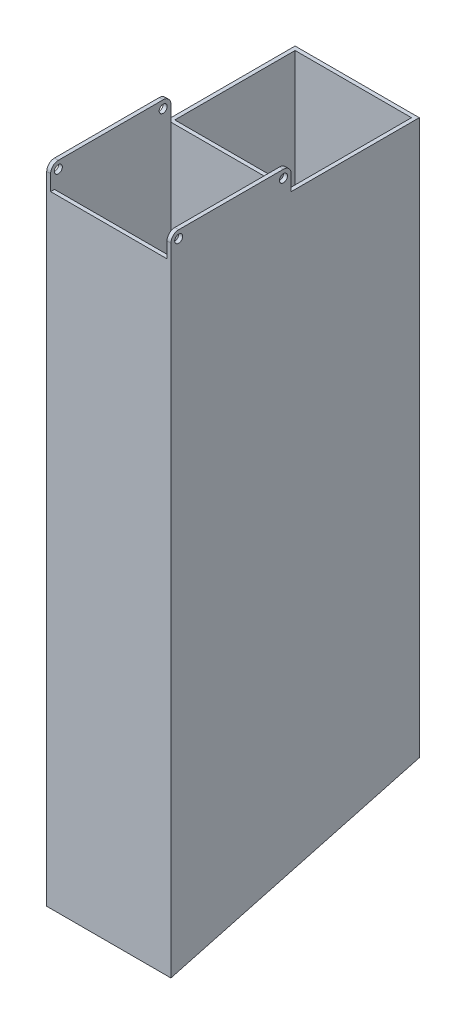
ISO-10303-21;
HEADER;
FILE_DESCRIPTION(('STEP AP214'),'2;1');
FILE_NAME('part.step','',(''),(''),'','','');
FILE_SCHEMA(('AUTOMOTIVE_DESIGN { 1 0 10303 214 1 1 1 1 }'));
ENDSEC;
DATA;
#1=APPLICATION_CONTEXT('core data for automotive mechanical design processes');
#2=APPLICATION_PROTOCOL_DEFINITION('international standard','automotive_design',2000,#1);
#3=PRODUCT_CONTEXT('',#1,'mechanical');
#4=PRODUCT('Part','Part','',(#3));
#5=PRODUCT_RELATED_PRODUCT_CATEGORY('part','',(#4));
#6=PRODUCT_DEFINITION_FORMATION('','',#4);
#7=PRODUCT_DEFINITION_CONTEXT('part definition',#1,'design');
#8=PRODUCT_DEFINITION('design','',#6,#7);
#9=PRODUCT_DEFINITION_SHAPE('','',#8);
#10=(LENGTH_UNIT() NAMED_UNIT(*) SI_UNIT(.MILLI.,.METRE.));
#11=(NAMED_UNIT(*) PLANE_ANGLE_UNIT() SI_UNIT($,.RADIAN.));
#12=(NAMED_UNIT(*) SI_UNIT($,.STERADIAN.) SOLID_ANGLE_UNIT());
#13=UNCERTAINTY_MEASURE_WITH_UNIT(LENGTH_MEASURE(1.E-05),#10,'distance_accuracy_value','');
#14=(GEOMETRIC_REPRESENTATION_CONTEXT(3) GLOBAL_UNCERTAINTY_ASSIGNED_CONTEXT((#13)) GLOBAL_UNIT_ASSIGNED_CONTEXT((#10,
#11,#12)) REPRESENTATION_CONTEXT('',''));
#15=CARTESIAN_POINT('',(0.,0.,0.));
#16=DIRECTION('',(0.,0.,1.));
#17=DIRECTION('',(1.,0.,0.));
#18=AXIS2_PLACEMENT_3D('',#15,#16,#17);
#19=CARTESIAN_POINT('',(0.,127.,0.));
#20=DIRECTION('',(0.,-1.,0.));
#21=DIRECTION('',(-1.,0.,0.));
#22=AXIS2_PLACEMENT_3D('',#19,#20,#21);
#23=PLANE('',#22);
#24=DIRECTION('',(0.,0.,1.));
#25=VECTOR('',#24,1.);
#26=CARTESIAN_POINT('',(23.8125,127.,-25.4));
#27=LINE('',#26,#25);
#28=CARTESIAN_POINT('',(23.8125,127.,-23.8125));
#29=VERTEX_POINT('',#28);
#30=CARTESIAN_POINT('',(23.8125,127.,25.4));
#31=VERTEX_POINT('',#30);
#32=EDGE_CURVE('E299',#29,#31,#27,.T.);
#33=ORIENTED_EDGE('',*,*,#32,.T.);
#34=DIRECTION('',(1.,0.,0.));
#35=VECTOR('',#34,1.);
#36=CARTESIAN_POINT('',(-25.4,127.,25.4));
#37=LINE('',#36,#35);
#38=CARTESIAN_POINT('',(-23.8125,127.,25.4));
#39=VERTEX_POINT('',#38);
#40=EDGE_CURVE('E265',#39,#31,#37,.T.);
#41=ORIENTED_EDGE('',*,*,#40,.F.);
#42=DIRECTION('',(0.,0.,-1.));
#43=VECTOR('',#42,1.);
#44=CARTESIAN_POINT('',(-23.8125,127.,-25.4));
#45=LINE('',#44,#43);
#46=CARTESIAN_POINT('',(-23.8125,127.,-23.8125));
#47=VERTEX_POINT('',#46);
#48=EDGE_CURVE('E442',#39,#47,#45,.T.);
#49=ORIENTED_EDGE('',*,*,#48,.T.);
#50=DIRECTION('',(1.,0.,0.));
#51=VECTOR('',#50,1.);
#52=CARTESIAN_POINT('',(-25.4,127.,-23.8125));
#53=LINE('',#52,#51);
#54=EDGE_CURVE('E445',#47,#29,#53,.T.);
#55=ORIENTED_EDGE('',*,*,#54,.T.);
#56=EDGE_LOOP('',(#33,#41,#49,#55));
#57=FACE_BOUND('',#56,.T.);
#58=DIRECTION('',(1.,0.,0.));
#59=VECTOR('',#58,1.);
#60=CARTESIAN_POINT('',(23.8125,127.,26.9875));
#61=LINE('',#60,#59);
#62=CARTESIAN_POINT('',(23.8125,127.,26.9875));
#63=VERTEX_POINT('',#62);
#64=CARTESIAN_POINT('',(25.4,127.,26.9875));
#65=VERTEX_POINT('',#64);
#66=EDGE_CURVE('E370',#63,#65,#61,.T.);
#67=ORIENTED_EDGE('',*,*,#66,.T.);
#68=DIRECTION('',(0.,0.,1.));
#69=VECTOR('',#68,1.);
#70=CARTESIAN_POINT('',(25.4,127.,-25.4));
#71=LINE('',#70,#69);
#72=CARTESIAN_POINT('',(25.4,127.,-25.4));
#73=VERTEX_POINT('',#72);
#74=EDGE_CURVE('E433',#73,#65,#71,.T.);
#75=ORIENTED_EDGE('',*,*,#74,.F.);
#76=DIRECTION('',(1.,0.,0.));
#77=VECTOR('',#76,1.);
#78=CARTESIAN_POINT('',(-25.4,127.,-25.4));
#79=LINE('',#78,#77);
#80=CARTESIAN_POINT('',(-25.4,127.,-25.4));
#81=VERTEX_POINT('',#80);
#82=EDGE_CURVE('E437',#81,#73,#79,.T.);
#83=ORIENTED_EDGE('',*,*,#82,.F.);
#84=DIRECTION('',(0.,0.,-1.));
#85=VECTOR('',#84,1.);
#86=CARTESIAN_POINT('',(-25.4,127.,-25.4));
#87=LINE('',#86,#85);
#88=CARTESIAN_POINT('',(-25.4,127.,26.9875));
#89=VERTEX_POINT('',#88);
#90=EDGE_CURVE('E246',#89,#81,#87,.T.);
#91=ORIENTED_EDGE('',*,*,#90,.F.);
#92=DIRECTION('',(-1.,0.,0.));
#93=VECTOR('',#92,1.);
#94=CARTESIAN_POINT('',(-23.8125,127.,26.9875));
#95=LINE('',#94,#93);
#96=CARTESIAN_POINT('',(-23.8125,127.,26.9875));
#97=VERTEX_POINT('',#96);
#98=EDGE_CURVE('E420',#97,#89,#95,.T.);
#99=ORIENTED_EDGE('',*,*,#98,.F.);
#100=DIRECTION('',(1.,0.,0.));
#101=VECTOR('',#100,1.);
#102=CARTESIAN_POINT('',(-25.4,127.,26.9875));
#103=LINE('',#102,#101);
#104=EDGE_CURVE('E261',#97,#63,#103,.T.);
#105=ORIENTED_EDGE('',*,*,#104,.T.);
#106=EDGE_LOOP('',(#67,#75,#83,#91,#99,#105));
#107=FACE_BOUND('',#106,.T.);
#108=ADVANCED_FACE('F77',(#57,#107),#23,.F.);
#109=DIRECTION('',(0.,0.,1.));
#110=VECTOR('',#109,1.);
#111=CARTESIAN_POINT('',(23.8125,127.,-25.4));
#112=LINE('',#111,#110);
#113=CARTESIAN_POINT('',(23.8125,127.,74.6125));
#114=VERTEX_POINT('',#113);
#115=CARTESIAN_POINT('',(23.8125,127.,76.2));
#116=VERTEX_POINT('',#115);
#117=EDGE_CURVE('E331',#114,#116,#112,.T.);
#118=ORIENTED_EDGE('',*,*,#117,.F.);
#119=DIRECTION('',(1.,0.,0.));
#120=VECTOR('',#119,1.);
#121=CARTESIAN_POINT('',(-25.4,127.,74.6125));
#122=LINE('',#121,#120);
#123=CARTESIAN_POINT('',(-23.8125,127.,74.6125));
#124=VERTEX_POINT('',#123);
#125=EDGE_CURVE('E274',#114,#124,#122,.F.);
#126=ORIENTED_EDGE('',*,*,#125,.T.);
#127=DIRECTION('',(0.,0.,-1.));
#128=VECTOR('',#127,1.);
#129=CARTESIAN_POINT('',(-23.8125,127.,0.));
#130=LINE('',#129,#128);
#131=CARTESIAN_POINT('',(-23.8125,127.,76.2));
#132=VERTEX_POINT('',#131);
#133=EDGE_CURVE('E388',#132,#124,#130,.T.);
#134=ORIENTED_EDGE('',*,*,#133,.F.);
#135=DIRECTION('',(-1.,0.,0.));
#136=VECTOR('',#135,1.);
#137=CARTESIAN_POINT('',(-25.4,127.,76.2));
#138=LINE('',#137,#136);
#139=EDGE_CURVE('E271',#116,#132,#138,.T.);
#140=ORIENTED_EDGE('',*,*,#139,.F.);
#141=EDGE_LOOP('',(#118,#126,#134,#140));
#142=FACE_BOUND('',#141,.T.);
#143=ADVANCED_FACE('F515',(#142),#23,.F.);
#144=CARTESIAN_POINT('',(25.4,127.,-25.4));
#145=DIRECTION('',(1.,0.,0.));
#146=DIRECTION('',(0.,0.,-1.));
#147=AXIS2_PLACEMENT_3D('',#144,#145,#146);
#148=PLANE('',#147);
#149=DIRECTION('',(0.,-0.258819045102515,0.96592582628907));
#150=VECTOR('',#149,1.);
#151=CARTESIAN_POINT('',(25.4,-127.,76.2));
#152=LINE('',#151,#150);
#153=CARTESIAN_POINT('',(25.4,-99.7763620489986,-25.4));
#154=VERTEX_POINT('',#153);
#155=CARTESIAN_POINT('',(25.4,-127.,76.2));
#156=VERTEX_POINT('',#155);
#157=EDGE_CURVE('E241',#154,#156,#152,.T.);
#158=ORIENTED_EDGE('',*,*,#157,.F.);
#159=DIRECTION('',(0.,-1.,0.));
#160=VECTOR('',#159,1.);
#161=CARTESIAN_POINT('',(25.4,127.,-25.4));
#162=LINE('',#161,#160);
#163=EDGE_CURVE('E239',#73,#154,#162,.T.);
#164=ORIENTED_EDGE('',*,*,#163,.F.);
#165=ORIENTED_EDGE('',*,*,#74,.T.);
#166=DIRECTION('',(0.,-1.,0.));
#167=VECTOR('',#166,1.);
#168=CARTESIAN_POINT('',(25.4,127.,26.9875));
#169=LINE('',#168,#167);
#170=CARTESIAN_POINT('',(25.4,133.35,26.9875));
#171=VERTEX_POINT('',#170);
#172=EDGE_CURVE('E350',#171,#65,#169,.T.);
#173=ORIENTED_EDGE('',*,*,#172,.F.);
#174=CARTESIAN_POINT('',(25.4,133.35,30.1625));
#175=DIRECTION('',(1.,0.,0.));
#176=DIRECTION('',(0.,0.,-1.));
#177=AXIS2_PLACEMENT_3D('',#174,#175,#176);
#178=CIRCLE('',#177,3.17499999999999);
#179=CARTESIAN_POINT('',(25.4,136.525,30.1625));
#180=VERTEX_POINT('',#179);
#181=EDGE_CURVE('E353',#171,#180,#178,.T.);
#182=ORIENTED_EDGE('',*,*,#181,.T.);
#183=DIRECTION('',(0.,0.,1.));
#184=VECTOR('',#183,1.);
#185=CARTESIAN_POINT('',(25.4,136.525,-25.4));
#186=LINE('',#185,#184);
#187=CARTESIAN_POINT('',(25.4,136.525,73.025));
#188=VERTEX_POINT('',#187);
#189=EDGE_CURVE('E328',#180,#188,#186,.T.);
#190=ORIENTED_EDGE('',*,*,#189,.T.);
#191=CARTESIAN_POINT('',(25.4,133.35,73.025));
#192=DIRECTION('',(1.,0.,0.));
#193=DIRECTION('',(0.,0.,-1.));
#194=AXIS2_PLACEMENT_3D('',#191,#192,#193);
#195=CIRCLE('',#194,3.175);
#196=CARTESIAN_POINT('',(25.4,133.35,76.2));
#197=VERTEX_POINT('',#196);
#198=EDGE_CURVE('E310',#188,#197,#195,.T.);
#199=ORIENTED_EDGE('',*,*,#198,.T.);
#200=DIRECTION('',(0.,-1.,0.));
#201=VECTOR('',#200,1.);
#202=CARTESIAN_POINT('',(25.4,127.,76.2));
#203=LINE('',#202,#201);
#204=EDGE_CURVE('E288',#197,#156,#203,.T.);
#205=ORIENTED_EDGE('',*,*,#204,.T.);
#206=EDGE_LOOP('',(#158,#164,#165,#173,#182,#190,#199,#205));
#207=FACE_BOUND('',#206,.T.);
#208=CARTESIAN_POINT('',(25.4,133.35,73.025));
#209=DIRECTION('',(-1.,0.,0.));
#210=DIRECTION('',(0.,0.,1.));
#211=AXIS2_PLACEMENT_3D('',#208,#209,#210);
#212=CIRCLE('',#211,1.63194999999999);
#213=CARTESIAN_POINT('',(25.4,133.35,74.65695));
#214=VERTEX_POINT('',#213);
#215=EDGE_CURVE('E486',#214,#214,#212,.T.);
#216=ORIENTED_EDGE('',*,*,#215,.T.);
#217=EDGE_LOOP('',(#216));
#218=FACE_BOUND('',#217,.T.);
#219=CARTESIAN_POINT('',(25.4,133.35,30.1625));
#220=DIRECTION('',(-1.,0.,0.));
#221=DIRECTION('',(0.,0.,1.));
#222=AXIS2_PLACEMENT_3D('',#219,#220,#221);
#223=CIRCLE('',#222,1.63194999999999);
#224=CARTESIAN_POINT('',(25.4,133.35,31.79445));
#225=VERTEX_POINT('',#224);
#226=EDGE_CURVE('E304',#225,#225,#223,.T.);
#227=ORIENTED_EDGE('',*,*,#226,.T.);
#228=EDGE_LOOP('',(#227));
#229=FACE_BOUND('',#228,.T.);
#230=ADVANCED_FACE('F522',(#207,#218,#229),#148,.T.);
#231=CARTESIAN_POINT('',(-25.4,127.,-25.4));
#232=DIRECTION('',(0.,0.,-1.));
#233=DIRECTION('',(-1.,0.,0.));
#234=AXIS2_PLACEMENT_3D('',#231,#232,#233);
#235=PLANE('',#234);
#236=DIRECTION('',(1.,0.,0.));
#237=VECTOR('',#236,1.);
#238=CARTESIAN_POINT('',(-130.584059929664,-99.7763620489986,-25.4));
#239=LINE('',#238,#237);
#240=CARTESIAN_POINT('',(-25.4,-99.7763620489986,-25.4));
#241=VERTEX_POINT('',#240);
#242=EDGE_CURVE('E222',#241,#154,#239,.T.);
#243=ORIENTED_EDGE('',*,*,#242,.F.);
#244=DIRECTION('',(0.,-1.,0.));
#245=VECTOR('',#244,1.);
#246=CARTESIAN_POINT('',(-25.4,127.,-25.4));
#247=LINE('',#246,#245);
#248=EDGE_CURVE('E237',#81,#241,#247,.T.);
#249=ORIENTED_EDGE('',*,*,#248,.F.);
#250=ORIENTED_EDGE('',*,*,#82,.T.);
#251=ORIENTED_EDGE('',*,*,#163,.T.);
#252=EDGE_LOOP('',(#243,#249,#250,#251));
#253=FACE_BOUND('',#252,.T.);
#254=ADVANCED_FACE('F235',(#253),#235,.T.);
#255=CARTESIAN_POINT('',(-25.4,127.,-25.4));
#256=DIRECTION('',(-1.,0.,0.));
#257=DIRECTION('',(0.,0.,1.));
#258=AXIS2_PLACEMENT_3D('',#255,#256,#257);
#259=PLANE('',#258);
#260=DIRECTION('',(0.,-0.258819045102515,0.96592582628907));
#261=VECTOR('',#260,1.);
#262=CARTESIAN_POINT('',(-25.4,-127.,76.2));
#263=LINE('',#262,#261);
#264=CARTESIAN_POINT('',(-25.4,-127.,76.2));
#265=VERTEX_POINT('',#264);
#266=EDGE_CURVE('E219',#241,#265,#263,.T.);
#267=ORIENTED_EDGE('',*,*,#266,.T.);
#268=DIRECTION('',(0.,-1.,0.));
#269=VECTOR('',#268,1.);
#270=CARTESIAN_POINT('',(-25.4,127.,76.2));
#271=LINE('',#270,#269);
#272=CARTESIAN_POINT('',(-25.4,133.35,76.2));
#273=VERTEX_POINT('',#272);
#274=EDGE_CURVE('E266',#273,#265,#271,.T.);
#275=ORIENTED_EDGE('',*,*,#274,.F.);
#276=CARTESIAN_POINT('',(-25.4,133.35,73.025));
#277=DIRECTION('',(-1.,0.,0.));
#278=DIRECTION('',(0.,0.,1.));
#279=AXIS2_PLACEMENT_3D('',#276,#277,#278);
#280=CIRCLE('',#279,3.175);
#281=CARTESIAN_POINT('',(-25.4,136.525,73.025));
#282=VERTEX_POINT('',#281);
#283=EDGE_CURVE('E382',#273,#282,#280,.T.);
#284=ORIENTED_EDGE('',*,*,#283,.T.);
#285=DIRECTION('',(0.,0.,-1.));
#286=VECTOR('',#285,1.);
#287=CARTESIAN_POINT('',(-25.4,136.525,0.));
#288=LINE('',#287,#286);
#289=CARTESIAN_POINT('',(-25.4,136.525,30.1625));
#290=VERTEX_POINT('',#289);
#291=EDGE_CURVE('E363',#282,#290,#288,.T.);
#292=ORIENTED_EDGE('',*,*,#291,.T.);
#293=CARTESIAN_POINT('',(-25.4,133.35,30.1625));
#294=DIRECTION('',(-1.,0.,0.));
#295=DIRECTION('',(0.,0.,1.));
#296=AXIS2_PLACEMENT_3D('',#293,#294,#295);
#297=CIRCLE('',#296,3.17499999999999);
#298=CARTESIAN_POINT('',(-25.4,133.35,26.9875));
#299=VERTEX_POINT('',#298);
#300=EDGE_CURVE('E404',#299,#290,#297,.F.);
#301=ORIENTED_EDGE('',*,*,#300,.F.);
#302=DIRECTION('',(0.,1.,0.));
#303=VECTOR('',#302,1.);
#304=CARTESIAN_POINT('',(-25.4,0.,26.9875));
#305=LINE('',#304,#303);
#306=EDGE_CURVE('E408',#89,#299,#305,.T.);
#307=ORIENTED_EDGE('',*,*,#306,.F.);
#308=ORIENTED_EDGE('',*,*,#90,.T.);
#309=ORIENTED_EDGE('',*,*,#248,.T.);
#310=EDGE_LOOP('',(#267,#275,#284,#292,#301,#307,#308,#309));
#311=FACE_BOUND('',#310,.T.);
#312=CARTESIAN_POINT('',(-25.4,133.35,73.025));
#313=DIRECTION('',(-1.,0.,0.));
#314=DIRECTION('',(0.,0.,1.));
#315=AXIS2_PLACEMENT_3D('',#312,#313,#314);
#316=CIRCLE('',#315,1.63194999999999);
#317=CARTESIAN_POINT('',(-25.4,133.35,74.65695));
#318=VERTEX_POINT('',#317);
#319=EDGE_CURVE('E482',#318,#318,#316,.T.);
#320=ORIENTED_EDGE('',*,*,#319,.F.);
#321=EDGE_LOOP('',(#320));
#322=FACE_BOUND('',#321,.T.);
#323=CARTESIAN_POINT('',(-25.4,133.35,30.1625));
#324=DIRECTION('',(-1.,0.,0.));
#325=DIRECTION('',(0.,0.,1.));
#326=AXIS2_PLACEMENT_3D('',#323,#324,#325);
#327=CIRCLE('',#326,1.63194999999999);
#328=CARTESIAN_POINT('',(-25.4,133.35,31.79445));
#329=VERTEX_POINT('',#328);
#330=EDGE_CURVE('E313',#329,#329,#327,.T.);
#331=ORIENTED_EDGE('',*,*,#330,.F.);
#332=EDGE_LOOP('',(#331));
#333=FACE_BOUND('',#332,.T.);
#334=ADVANCED_FACE('F243',(#311,#322,#333),#259,.T.);
#335=CARTESIAN_POINT('',(-23.8125,127.,-25.4));
#336=DIRECTION('',(-1.,0.,0.));
#337=DIRECTION('',(0.,0.,1.));
#338=AXIS2_PLACEMENT_3D('',#335,#336,#337);
#339=PLANE('',#338);
#340=DIRECTION('',(0.,-1.,0.));
#341=VECTOR('',#340,1.);
#342=CARTESIAN_POINT('',(-23.8125,127.,25.4));
#343=LINE('',#342,#341);
#344=CARTESIAN_POINT('',(-23.8125,-113.388181024499,25.4));
#345=VERTEX_POINT('',#344);
#346=EDGE_CURVE('E248',#39,#345,#343,.T.);
#347=ORIENTED_EDGE('',*,*,#346,.T.);
#348=DIRECTION('',(0.,0.258819045102515,-0.96592582628907));
#349=VECTOR('',#348,1.);
#350=CARTESIAN_POINT('',(-23.8125,-84.585226280625,-82.0940905122484));
#351=LINE('',#350,#349);
#352=CARTESIAN_POINT('',(-23.8125,-100.201731391983,-23.8125));
#353=VERTEX_POINT('',#352);
#354=EDGE_CURVE('E100',#345,#353,#351,.T.);
#355=ORIENTED_EDGE('',*,*,#354,.T.);
#356=DIRECTION('',(0.,-1.,0.));
#357=VECTOR('',#356,1.);
#358=CARTESIAN_POINT('',(-23.8125,127.,-23.8125));
#359=LINE('',#358,#357);
#360=EDGE_CURVE('E254',#47,#353,#359,.T.);
#361=ORIENTED_EDGE('',*,*,#360,.F.);
#362=ORIENTED_EDGE('',*,*,#48,.F.);
#363=EDGE_LOOP('',(#347,#355,#361,#362));
#364=FACE_BOUND('',#363,.T.);
#365=ADVANCED_FACE('F462',(#364),#339,.F.);
#366=CARTESIAN_POINT('',(-25.4,127.,-23.8125));
#367=DIRECTION('',(0.,0.,-1.));
#368=DIRECTION('',(-1.,0.,0.));
#369=AXIS2_PLACEMENT_3D('',#366,#367,#368);
#370=PLANE('',#369);
#371=ORIENTED_EDGE('',*,*,#360,.T.);
#372=DIRECTION('',(1.,0.,0.));
#373=VECTOR('',#372,1.);
#374=CARTESIAN_POINT('',(-25.4,-100.201731391983,-23.8125));
#375=LINE('',#374,#373);
#376=CARTESIAN_POINT('',(23.8125,-100.201731391983,-23.8125));
#377=VERTEX_POINT('',#376);
#378=EDGE_CURVE('E459',#353,#377,#375,.T.);
#379=ORIENTED_EDGE('',*,*,#378,.T.);
#380=DIRECTION('',(0.,-1.,0.));
#381=VECTOR('',#380,1.);
#382=CARTESIAN_POINT('',(23.8125,127.,-23.8125));
#383=LINE('',#382,#381);
#384=EDGE_CURVE('E448',#29,#377,#383,.T.);
#385=ORIENTED_EDGE('',*,*,#384,.F.);
#386=ORIENTED_EDGE('',*,*,#54,.F.);
#387=EDGE_LOOP('',(#371,#379,#385,#386));
#388=FACE_BOUND('',#387,.T.);
#389=ADVANCED_FACE('F457',(#388),#370,.F.);
#390=CARTESIAN_POINT('',(23.8125,127.,-25.4));
#391=DIRECTION('',(1.,0.,0.));
#392=DIRECTION('',(0.,0.,-1.));
#393=AXIS2_PLACEMENT_3D('',#390,#391,#392);
#394=PLANE('',#393);
#395=ORIENTED_EDGE('',*,*,#384,.T.);
#396=DIRECTION('',(0.,-0.258819045102515,0.96592582628907));
#397=VECTOR('',#396,1.);
#398=CARTESIAN_POINT('',(23.8125,-84.585226280625,-82.0940905122484));
#399=LINE('',#398,#397);
#400=CARTESIAN_POINT('',(23.8125,-113.388181024499,25.4));
#401=VERTEX_POINT('',#400);
#402=EDGE_CURVE('E230',#377,#401,#399,.T.);
#403=ORIENTED_EDGE('',*,*,#402,.T.);
#404=DIRECTION('',(0.,-1.,0.));
#405=VECTOR('',#404,1.);
#406=CARTESIAN_POINT('',(23.8125,127.,25.4));
#407=LINE('',#406,#405);
#408=EDGE_CURVE('E86',#31,#401,#407,.T.);
#409=ORIENTED_EDGE('',*,*,#408,.F.);
#410=ORIENTED_EDGE('',*,*,#32,.F.);
#411=EDGE_LOOP('',(#395,#403,#409,#410));
#412=FACE_BOUND('',#411,.T.);
#413=ADVANCED_FACE('F531',(#412),#394,.F.);
#414=CARTESIAN_POINT('',(23.8125,127.,25.4));
#415=DIRECTION('',(1.,0.,0.));
#416=DIRECTION('',(0.,0.,-1.));
#417=AXIS2_PLACEMENT_3D('',#414,#415,#416);
#418=PLANE('',#417);
#419=CARTESIAN_POINT('',(23.8125,133.35,73.025));
#420=DIRECTION('',(1.,0.,0.));
#421=DIRECTION('',(0.,0.,-1.));
#422=AXIS2_PLACEMENT_3D('',#419,#420,#421);
#423=CIRCLE('',#422,1.63194999999999);
#424=CARTESIAN_POINT('',(23.8125,133.35,71.39305));
#425=VERTEX_POINT('',#424);
#426=EDGE_CURVE('E490',#425,#425,#423,.T.);
#427=ORIENTED_EDGE('',*,*,#426,.T.);
#428=EDGE_LOOP('',(#427));
#429=FACE_BOUND('',#428,.T.);
#430=CARTESIAN_POINT('',(23.8125,133.35,30.1625));
#431=DIRECTION('',(1.,0.,0.));
#432=DIRECTION('',(0.,0.,-1.));
#433=AXIS2_PLACEMENT_3D('',#430,#431,#432);
#434=CIRCLE('',#433,1.63194999999999);
#435=CARTESIAN_POINT('',(23.8125,133.35,28.53055));
#436=VERTEX_POINT('',#435);
#437=EDGE_CURVE('E300',#436,#436,#434,.T.);
#438=ORIENTED_EDGE('',*,*,#437,.T.);
#439=EDGE_LOOP('',(#438));
#440=FACE_BOUND('',#439,.T.);
#441=DIRECTION('',(0.,-1.,0.));
#442=VECTOR('',#441,1.);
#443=CARTESIAN_POINT('',(23.8125,127.,26.9875));
#444=LINE('',#443,#442);
#445=CARTESIAN_POINT('',(23.8125,-113.813550367484,26.9875));
#446=VERTEX_POINT('',#445);
#447=EDGE_CURVE('E270',#63,#446,#444,.T.);
#448=ORIENTED_EDGE('',*,*,#447,.T.);
#449=DIRECTION('',(0.,-0.258819045102515,0.96592582628907));
#450=VECTOR('',#449,1.);
#451=CARTESIAN_POINT('',(23.8125,-97.2852262806248,-34.6970452561235));
#452=LINE('',#451,#450);
#453=CARTESIAN_POINT('',(23.8125,-126.574630657016,74.6125));
#454=VERTEX_POINT('',#453);
#455=EDGE_CURVE('E93',#446,#454,#452,.T.);
#456=ORIENTED_EDGE('',*,*,#455,.T.);
#457=DIRECTION('',(0.,-1.,0.));
#458=VECTOR('',#457,1.);
#459=CARTESIAN_POINT('',(23.8125,127.,74.6125));
#460=LINE('',#459,#458);
#461=EDGE_CURVE('E284',#114,#454,#460,.T.);
#462=ORIENTED_EDGE('',*,*,#461,.F.);
#463=ORIENTED_EDGE('',*,*,#117,.T.);
#464=DIRECTION('',(0.,1.,0.));
#465=VECTOR('',#464,1.);
#466=CARTESIAN_POINT('',(23.8125,127.,76.2));
#467=LINE('',#466,#465);
#468=CARTESIAN_POINT('',(23.8125,133.35,76.2));
#469=VERTEX_POINT('',#468);
#470=EDGE_CURVE('E327',#116,#469,#467,.T.);
#471=ORIENTED_EDGE('',*,*,#470,.T.);
#472=CARTESIAN_POINT('',(23.8125,133.35,73.025));
#473=DIRECTION('',(1.,0.,0.));
#474=DIRECTION('',(0.,0.,-1.));
#475=AXIS2_PLACEMENT_3D('',#472,#473,#474);
#476=CIRCLE('',#475,3.175);
#477=CARTESIAN_POINT('',(23.8125,136.525,73.025));
#478=VERTEX_POINT('',#477);
#479=EDGE_CURVE('E323',#478,#469,#476,.T.);
#480=ORIENTED_EDGE('',*,*,#479,.F.);
#481=DIRECTION('',(0.,0.,1.));
#482=VECTOR('',#481,1.);
#483=CARTESIAN_POINT('',(23.8125,136.525,-25.4));
#484=LINE('',#483,#482);
#485=CARTESIAN_POINT('',(23.8125,136.525,30.1625));
#486=VERTEX_POINT('',#485);
#487=EDGE_CURVE('E342',#486,#478,#484,.T.);
#488=ORIENTED_EDGE('',*,*,#487,.F.);
#489=CARTESIAN_POINT('',(23.8125,133.35,30.1625));
#490=DIRECTION('',(1.,0.,0.));
#491=DIRECTION('',(0.,0.,-1.));
#492=AXIS2_PLACEMENT_3D('',#489,#490,#491);
#493=CIRCLE('',#492,3.17499999999999);
#494=CARTESIAN_POINT('',(23.8125,133.35,26.9875));
#495=VERTEX_POINT('',#494);
#496=EDGE_CURVE('E338',#495,#486,#493,.T.);
#497=ORIENTED_EDGE('',*,*,#496,.F.);
#498=DIRECTION('',(0.,-1.,0.));
#499=VECTOR('',#498,1.);
#500=CARTESIAN_POINT('',(23.8125,127.,26.9875));
#501=LINE('',#500,#499);
#502=EDGE_CURVE('E335',#495,#63,#501,.T.);
#503=ORIENTED_EDGE('',*,*,#502,.T.);
#504=EDGE_LOOP('',(#448,#456,#462,#463,#471,#480,#488,#497,#503));
#505=FACE_BOUND('',#504,.T.);
#506=ADVANCED_FACE('F543',(#429,#440,#505),#418,.F.);
#507=CARTESIAN_POINT('',(-25.4,127.,74.6125));
#508=DIRECTION('',(0.,0.,1.));
#509=DIRECTION('',(1.,0.,0.));
#510=AXIS2_PLACEMENT_3D('',#507,#508,#509);
#511=PLANE('',#510);
#512=ORIENTED_EDGE('',*,*,#461,.T.);
#513=DIRECTION('',(-1.,0.,0.));
#514=VECTOR('',#513,1.);
#515=CARTESIAN_POINT('',(-25.4,-126.574630657016,74.6125));
#516=LINE('',#515,#514);
#517=CARTESIAN_POINT('',(-23.8125,-126.574630657016,74.6125));
#518=VERTEX_POINT('',#517);
#519=EDGE_CURVE('E476',#454,#518,#516,.T.);
#520=ORIENTED_EDGE('',*,*,#519,.T.);
#521=DIRECTION('',(0.,-1.,0.));
#522=VECTOR('',#521,1.);
#523=CARTESIAN_POINT('',(-23.8125,127.,74.6125));
#524=LINE('',#523,#522);
#525=EDGE_CURVE('E277',#124,#518,#524,.T.);
#526=ORIENTED_EDGE('',*,*,#525,.F.);
#527=ORIENTED_EDGE('',*,*,#125,.F.);
#528=EDGE_LOOP('',(#512,#520,#526,#527));
#529=FACE_BOUND('',#528,.T.);
#530=ADVANCED_FACE('F554',(#529),#511,.F.);
#531=CARTESIAN_POINT('',(-23.8125,127.,25.4));
#532=DIRECTION('',(-1.,0.,0.));
#533=DIRECTION('',(0.,0.,1.));
#534=AXIS2_PLACEMENT_3D('',#531,#532,#533);
#535=PLANE('',#534);
#536=CARTESIAN_POINT('',(-23.8125,133.35,73.025));
#537=DIRECTION('',(-1.,0.,0.));
#538=DIRECTION('',(0.,0.,1.));
#539=AXIS2_PLACEMENT_3D('',#536,#537,#538);
#540=CIRCLE('',#539,1.63194999999999);
#541=CARTESIAN_POINT('',(-23.8125,133.35,74.65695));
#542=VERTEX_POINT('',#541);
#543=EDGE_CURVE('E319',#542,#542,#540,.T.);
#544=ORIENTED_EDGE('',*,*,#543,.T.);
#545=EDGE_LOOP('',(#544));
#546=FACE_BOUND('',#545,.T.);
#547=CARTESIAN_POINT('',(-23.8125,133.35,30.1625));
#548=DIRECTION('',(-1.,0.,0.));
#549=DIRECTION('',(0.,0.,1.));
#550=AXIS2_PLACEMENT_3D('',#547,#548,#549);
#551=CIRCLE('',#550,1.63194999999999);
#552=CARTESIAN_POINT('',(-23.8125,133.35,31.79445));
#553=VERTEX_POINT('',#552);
#554=EDGE_CURVE('E303',#553,#553,#551,.T.);
#555=ORIENTED_EDGE('',*,*,#554,.T.);
#556=EDGE_LOOP('',(#555));
#557=FACE_BOUND('',#556,.T.);
#558=ORIENTED_EDGE('',*,*,#525,.T.);
#559=DIRECTION('',(0.,0.258819045102515,-0.96592582628907));
#560=VECTOR('',#559,1.);
#561=CARTESIAN_POINT('',(-23.8125,-97.2852262806248,-34.6970452561235));
#562=LINE('',#561,#560);
#563=CARTESIAN_POINT('',(-23.8125,-113.813550367484,26.9875));
#564=VERTEX_POINT('',#563);
#565=EDGE_CURVE('E468',#518,#564,#562,.T.);
#566=ORIENTED_EDGE('',*,*,#565,.T.);
#567=DIRECTION('',(0.,1.,0.));
#568=VECTOR('',#567,1.);
#569=CARTESIAN_POINT('',(-23.8125,127.,26.9875));
#570=LINE('',#569,#568);
#571=EDGE_CURVE('E297',#564,#97,#570,.T.);
#572=ORIENTED_EDGE('',*,*,#571,.T.);
#573=DIRECTION('',(0.,1.,0.));
#574=VECTOR('',#573,1.);
#575=CARTESIAN_POINT('',(-23.8125,0.,26.9875));
#576=LINE('',#575,#574);
#577=CARTESIAN_POINT('',(-23.8125,133.35,26.9875));
#578=VERTEX_POINT('',#577);
#579=EDGE_CURVE('E385',#97,#578,#576,.T.);
#580=ORIENTED_EDGE('',*,*,#579,.T.);
#581=CARTESIAN_POINT('',(-23.8125,133.35,30.1625));
#582=DIRECTION('',(-1.,0.,0.));
#583=DIRECTION('',(0.,0.,1.));
#584=AXIS2_PLACEMENT_3D('',#581,#582,#583);
#585=CIRCLE('',#584,3.17499999999999);
#586=CARTESIAN_POINT('',(-23.8125,136.525,30.1625));
#587=VERTEX_POINT('',#586);
#588=EDGE_CURVE('E381',#578,#587,#585,.F.);
#589=ORIENTED_EDGE('',*,*,#588,.T.);
#590=DIRECTION('',(0.,0.,-1.));
#591=VECTOR('',#590,1.);
#592=CARTESIAN_POINT('',(-23.8125,136.525,0.));
#593=LINE('',#592,#591);
#594=CARTESIAN_POINT('',(-23.8125,136.525,73.025));
#595=VERTEX_POINT('',#594);
#596=EDGE_CURVE('E377',#595,#587,#593,.T.);
#597=ORIENTED_EDGE('',*,*,#596,.F.);
#598=CARTESIAN_POINT('',(-23.8125,133.35,73.025));
#599=DIRECTION('',(-1.,0.,0.));
#600=DIRECTION('',(0.,0.,1.));
#601=AXIS2_PLACEMENT_3D('',#598,#599,#600);
#602=CIRCLE('',#601,3.175);
#603=CARTESIAN_POINT('',(-23.8125,133.35,76.2));
#604=VERTEX_POINT('',#603);
#605=EDGE_CURVE('E396',#604,#595,#602,.T.);
#606=ORIENTED_EDGE('',*,*,#605,.F.);
#607=DIRECTION('',(0.,-1.,0.));
#608=VECTOR('',#607,1.);
#609=CARTESIAN_POINT('',(-23.8125,0.,76.2));
#610=LINE('',#609,#608);
#611=EDGE_CURVE('E392',#604,#132,#610,.T.);
#612=ORIENTED_EDGE('',*,*,#611,.T.);
#613=ORIENTED_EDGE('',*,*,#133,.T.);
#614=EDGE_LOOP('',(#558,#566,#572,#580,#589,#597,#606,#612,#613));
#615=FACE_BOUND('',#614,.T.);
#616=ADVANCED_FACE('F79',(#546,#557,#615),#535,.F.);
#617=CARTESIAN_POINT('',(-25.4,127.,76.2));
#618=DIRECTION('',(0.,0.,1.));
#619=DIRECTION('',(1.,0.,0.));
#620=AXIS2_PLACEMENT_3D('',#617,#618,#619);
#621=PLANE('',#620);
#622=DIRECTION('',(-1.,0.,0.));
#623=VECTOR('',#622,1.);
#624=CARTESIAN_POINT('',(-25.4,-127.,76.2));
#625=LINE('',#624,#623);
#626=EDGE_CURVE('E225',#156,#265,#625,.T.);
#627=ORIENTED_EDGE('',*,*,#626,.F.);
#628=ORIENTED_EDGE('',*,*,#204,.F.);
#629=DIRECTION('',(1.,0.,0.));
#630=VECTOR('',#629,1.);
#631=CARTESIAN_POINT('',(23.8125,133.35,76.2));
#632=LINE('',#631,#630);
#633=EDGE_CURVE('E346',#469,#197,#632,.T.);
#634=ORIENTED_EDGE('',*,*,#633,.F.);
#635=ORIENTED_EDGE('',*,*,#470,.F.);
#636=ORIENTED_EDGE('',*,*,#139,.T.);
#637=ORIENTED_EDGE('',*,*,#611,.F.);
#638=DIRECTION('',(-1.,0.,0.));
#639=VECTOR('',#638,1.);
#640=CARTESIAN_POINT('',(-23.8125,133.35,76.2));
#641=LINE('',#640,#639);
#642=EDGE_CURVE('E416',#604,#273,#641,.T.);
#643=ORIENTED_EDGE('',*,*,#642,.T.);
#644=ORIENTED_EDGE('',*,*,#274,.T.);
#645=EDGE_LOOP('',(#627,#628,#634,#635,#636,#637,#643,#644));
#646=FACE_BOUND('',#645,.T.);
#647=ADVANCED_FACE('F552',(#646),#621,.T.);
#648=CARTESIAN_POINT('',(-25.4,127.,26.9875));
#649=DIRECTION('',(0.,0.,-1.));
#650=DIRECTION('',(-1.,0.,0.));
#651=AXIS2_PLACEMENT_3D('',#648,#649,#650);
#652=PLANE('',#651);
#653=ORIENTED_EDGE('',*,*,#571,.F.);
#654=DIRECTION('',(1.,0.,0.));
#655=VECTOR('',#654,1.);
#656=CARTESIAN_POINT('',(-25.4,-113.813550367484,26.9875));
#657=LINE('',#656,#655);
#658=EDGE_CURVE('E464',#564,#446,#657,.T.);
#659=ORIENTED_EDGE('',*,*,#658,.T.);
#660=ORIENTED_EDGE('',*,*,#447,.F.);
#661=ORIENTED_EDGE('',*,*,#104,.F.);
#662=EDGE_LOOP('',(#653,#659,#660,#661));
#663=FACE_BOUND('',#662,.T.);
#664=ADVANCED_FACE('F548',(#663),#652,.F.);
#665=CARTESIAN_POINT('',(-25.4,127.,25.4));
#666=DIRECTION('',(0.,0.,-1.));
#667=DIRECTION('',(-1.,0.,0.));
#668=AXIS2_PLACEMENT_3D('',#665,#666,#667);
#669=PLANE('',#668);
#670=DIRECTION('',(1.,0.,0.));
#671=VECTOR('',#670,1.);
#672=CARTESIAN_POINT('',(-25.4,-113.388181024499,25.4));
#673=LINE('',#672,#671);
#674=EDGE_CURVE('E12',#345,#401,#673,.T.);
#675=ORIENTED_EDGE('',*,*,#674,.F.);
#676=ORIENTED_EDGE('',*,*,#346,.F.);
#677=ORIENTED_EDGE('',*,*,#40,.T.);
#678=ORIENTED_EDGE('',*,*,#408,.T.);
#679=EDGE_LOOP('',(#675,#676,#677,#678));
#680=FACE_BOUND('',#679,.T.);
#681=ADVANCED_FACE('F545',(#680),#669,.T.);
#682=CARTESIAN_POINT('',(-23.8125,136.525,0.));
#683=DIRECTION('',(0.,1.,0.));
#684=DIRECTION('',(0.,0.,1.));
#685=AXIS2_PLACEMENT_3D('',#682,#683,#684);
#686=PLANE('',#685);
#687=ORIENTED_EDGE('',*,*,#291,.F.);
#688=DIRECTION('',(-1.,0.,0.));
#689=VECTOR('',#688,1.);
#690=CARTESIAN_POINT('',(-23.8125,136.525,73.025));
#691=LINE('',#690,#689);
#692=EDGE_CURVE('E280',#595,#282,#691,.T.);
#693=ORIENTED_EDGE('',*,*,#692,.F.);
#694=ORIENTED_EDGE('',*,*,#596,.T.);
#695=DIRECTION('',(-1.,0.,0.));
#696=VECTOR('',#695,1.);
#697=CARTESIAN_POINT('',(-23.8125,136.525,30.1625));
#698=LINE('',#697,#696);
#699=EDGE_CURVE('E400',#587,#290,#698,.T.);
#700=ORIENTED_EDGE('',*,*,#699,.T.);
#701=EDGE_LOOP('',(#687,#693,#694,#700));
#702=FACE_BOUND('',#701,.T.);
#703=ADVANCED_FACE('F527',(#702),#686,.T.);
#704=CARTESIAN_POINT('',(-23.8125,133.35,73.025));
#705=DIRECTION('',(-1.,0.,0.));
#706=DIRECTION('',(0.,0.,1.));
#707=AXIS2_PLACEMENT_3D('',#704,#705,#706);
#708=CYLINDRICAL_SURFACE('',#707,3.175);
#709=ORIENTED_EDGE('',*,*,#283,.F.);
#710=ORIENTED_EDGE('',*,*,#642,.F.);
#711=ORIENTED_EDGE('',*,*,#605,.T.);
#712=ORIENTED_EDGE('',*,*,#692,.T.);
#713=EDGE_LOOP('',(#709,#710,#711,#712));
#714=FACE_BOUND('',#713,.T.);
#715=ADVANCED_FACE('F566',(#714),#708,.T.);
#716=CARTESIAN_POINT('',(-23.8125,0.,26.9875));
#717=DIRECTION('',(0.,0.,1.));
#718=DIRECTION('',(1.,0.,0.));
#719=AXIS2_PLACEMENT_3D('',#716,#717,#718);
#720=PLANE('',#719);
#721=ORIENTED_EDGE('',*,*,#306,.T.);
#722=DIRECTION('',(-1.,0.,0.));
#723=VECTOR('',#722,1.);
#724=CARTESIAN_POINT('',(-23.8125,133.35,26.9875));
#725=LINE('',#724,#723);
#726=EDGE_CURVE('E424',#578,#299,#725,.T.);
#727=ORIENTED_EDGE('',*,*,#726,.F.);
#728=ORIENTED_EDGE('',*,*,#579,.F.);
#729=ORIENTED_EDGE('',*,*,#98,.T.);
#730=EDGE_LOOP('',(#721,#727,#728,#729));
#731=FACE_BOUND('',#730,.T.);
#732=ADVANCED_FACE('F571',(#731),#720,.F.);
#733=CARTESIAN_POINT('',(-23.8125,133.35,30.1625));
#734=DIRECTION('',(-1.,0.,0.));
#735=DIRECTION('',(0.,0.,1.));
#736=AXIS2_PLACEMENT_3D('',#733,#734,#735);
#737=CYLINDRICAL_SURFACE('',#736,3.17499999999999);
#738=ORIENTED_EDGE('',*,*,#300,.T.);
#739=ORIENTED_EDGE('',*,*,#699,.F.);
#740=ORIENTED_EDGE('',*,*,#588,.F.);
#741=ORIENTED_EDGE('',*,*,#726,.T.);
#742=EDGE_LOOP('',(#738,#739,#740,#741));
#743=FACE_BOUND('',#742,.T.);
#744=ADVANCED_FACE('F586',(#743),#737,.T.);
#745=CARTESIAN_POINT('',(23.8125,133.35,73.025));
#746=DIRECTION('',(1.,0.,0.));
#747=DIRECTION('',(0.,0.,-1.));
#748=AXIS2_PLACEMENT_3D('',#745,#746,#747);
#749=CYLINDRICAL_SURFACE('',#748,3.175);
#750=ORIENTED_EDGE('',*,*,#198,.F.);
#751=DIRECTION('',(1.,0.,0.));
#752=VECTOR('',#751,1.);
#753=CARTESIAN_POINT('',(23.8125,136.525,73.025));
#754=LINE('',#753,#752);
#755=EDGE_CURVE('E360',#478,#188,#754,.T.);
#756=ORIENTED_EDGE('',*,*,#755,.F.);
#757=ORIENTED_EDGE('',*,*,#479,.T.);
#758=ORIENTED_EDGE('',*,*,#633,.T.);
#759=EDGE_LOOP('',(#750,#756,#757,#758));
#760=FACE_BOUND('',#759,.T.);
#761=ADVANCED_FACE('F620',(#760),#749,.T.);
#762=CARTESIAN_POINT('',(23.8125,136.525,-25.4));
#763=DIRECTION('',(0.,1.,0.));
#764=DIRECTION('',(0.,0.,1.));
#765=AXIS2_PLACEMENT_3D('',#762,#763,#764);
#766=PLANE('',#765);
#767=ORIENTED_EDGE('',*,*,#189,.F.);
#768=DIRECTION('',(1.,0.,0.));
#769=VECTOR('',#768,1.);
#770=CARTESIAN_POINT('',(23.8125,136.525,30.1625));
#771=LINE('',#770,#769);
#772=EDGE_CURVE('E364',#486,#180,#771,.T.);
#773=ORIENTED_EDGE('',*,*,#772,.F.);
#774=ORIENTED_EDGE('',*,*,#487,.T.);
#775=ORIENTED_EDGE('',*,*,#755,.T.);
#776=EDGE_LOOP('',(#767,#773,#774,#775));
#777=FACE_BOUND('',#776,.T.);
#778=ADVANCED_FACE('F616',(#777),#766,.T.);
#779=CARTESIAN_POINT('',(23.8125,133.35,30.1625));
#780=DIRECTION('',(1.,0.,0.));
#781=DIRECTION('',(0.,0.,-1.));
#782=AXIS2_PLACEMENT_3D('',#779,#780,#781);
#783=CYLINDRICAL_SURFACE('',#782,3.17499999999999);
#784=ORIENTED_EDGE('',*,*,#181,.F.);
#785=DIRECTION('',(1.,0.,0.));
#786=VECTOR('',#785,1.);
#787=CARTESIAN_POINT('',(23.8125,133.35,26.9875));
#788=LINE('',#787,#786);
#789=EDGE_CURVE('E367',#495,#171,#788,.T.);
#790=ORIENTED_EDGE('',*,*,#789,.F.);
#791=ORIENTED_EDGE('',*,*,#496,.T.);
#792=ORIENTED_EDGE('',*,*,#772,.T.);
#793=EDGE_LOOP('',(#784,#790,#791,#792));
#794=FACE_BOUND('',#793,.T.);
#795=ADVANCED_FACE('F613',(#794),#783,.T.);
#796=CARTESIAN_POINT('',(23.8125,127.,26.9875));
#797=DIRECTION('',(0.,0.,1.));
#798=DIRECTION('',(1.,0.,0.));
#799=AXIS2_PLACEMENT_3D('',#796,#797,#798);
#800=PLANE('',#799);
#801=ORIENTED_EDGE('',*,*,#172,.T.);
#802=ORIENTED_EDGE('',*,*,#66,.F.);
#803=ORIENTED_EDGE('',*,*,#502,.F.);
#804=ORIENTED_EDGE('',*,*,#789,.T.);
#805=EDGE_LOOP('',(#801,#802,#803,#804));
#806=FACE_BOUND('',#805,.T.);
#807=ADVANCED_FACE('F611',(#806),#800,.F.);
#808=CARTESIAN_POINT('',(-25.4,133.35,30.1625));
#809=DIRECTION('',(-1.,0.,0.));
#810=DIRECTION('',(0.,0.,1.));
#811=AXIS2_PLACEMENT_3D('',#808,#809,#810);
#812=CYLINDRICAL_SURFACE('',#811,1.63194999999999);
#813=ORIENTED_EDGE('',*,*,#226,.F.);
#814=EDGE_LOOP('',(#813));
#815=FACE_BOUND('',#814,.T.);
#816=ORIENTED_EDGE('',*,*,#437,.F.);
#817=EDGE_LOOP('',(#816));
#818=FACE_BOUND('',#817,.T.);
#819=ADVANCED_FACE('F510',(#815,#818),#812,.F.);
#820=ORIENTED_EDGE('',*,*,#330,.T.);
#821=EDGE_LOOP('',(#820));
#822=FACE_BOUND('',#821,.T.);
#823=ORIENTED_EDGE('',*,*,#554,.F.);
#824=EDGE_LOOP('',(#823));
#825=FACE_BOUND('',#824,.T.);
#826=ADVANCED_FACE('F502',(#822,#825),#812,.F.);
#827=CARTESIAN_POINT('',(-25.4,133.35,73.025));
#828=DIRECTION('',(-1.,0.,0.));
#829=DIRECTION('',(0.,0.,1.));
#830=AXIS2_PLACEMENT_3D('',#827,#828,#829);
#831=CYLINDRICAL_SURFACE('',#830,1.63194999999999);
#832=ORIENTED_EDGE('',*,*,#319,.T.);
#833=EDGE_LOOP('',(#832));
#834=FACE_BOUND('',#833,.T.);
#835=ORIENTED_EDGE('',*,*,#543,.F.);
#836=EDGE_LOOP('',(#835));
#837=FACE_BOUND('',#836,.T.);
#838=ADVANCED_FACE('F499',(#834,#837),#831,.F.);
#839=ORIENTED_EDGE('',*,*,#215,.F.);
#840=EDGE_LOOP('',(#839));
#841=FACE_BOUND('',#840,.T.);
#842=ORIENTED_EDGE('',*,*,#426,.F.);
#843=EDGE_LOOP('',(#842));
#844=FACE_BOUND('',#843,.T.);
#845=ADVANCED_FACE('F501',(#841,#844),#831,.F.);
#846=CARTESIAN_POINT('',(-130.584059929664,-127.,76.2));
#847=DIRECTION('',(0.,0.96592582628907,0.258819045102515));
#848=DIRECTION('',(0.,-0.258819045102515,0.96592582628907));
#849=AXIS2_PLACEMENT_3D('',#846,#847,#848);
#850=PLANE('',#849);
#851=ORIENTED_EDGE('',*,*,#242,.T.);
#852=ORIENTED_EDGE('',*,*,#157,.T.);
#853=ORIENTED_EDGE('',*,*,#626,.T.);
#854=ORIENTED_EDGE('',*,*,#266,.F.);
#855=EDGE_LOOP('',(#851,#852,#853,#854));
#856=FACE_BOUND('',#855,.T.);
#857=ORIENTED_EDGE('',*,*,#674,.T.);
#858=ORIENTED_EDGE('',*,*,#402,.F.);
#859=ORIENTED_EDGE('',*,*,#378,.F.);
#860=ORIENTED_EDGE('',*,*,#354,.F.);
#861=EDGE_LOOP('',(#857,#858,#859,#860));
#862=FACE_BOUND('',#861,.T.);
#863=ORIENTED_EDGE('',*,*,#658,.F.);
#864=ORIENTED_EDGE('',*,*,#565,.F.);
#865=ORIENTED_EDGE('',*,*,#519,.F.);
#866=ORIENTED_EDGE('',*,*,#455,.F.);
#867=EDGE_LOOP('',(#863,#864,#865,#866));
#868=FACE_BOUND('',#867,.T.);
#869=ADVANCED_FACE('F221',(#856,#862,#868),#850,.F.);
#870=CLOSED_SHELL('',(#108,#143,#230,#254,#334,#365,#389,#413,#506,#530,#616,#647,#664,#681,
#703,#715,#732,#744,#761,#778,#795,#807,#819,#826,#838,#845,#869));
#871=MANIFOLD_SOLID_BREP('B2',#870);
#872=ADVANCED_BREP_SHAPE_REPRESENTATION('',(#18,#871),#14);
#873=SHAPE_DEFINITION_REPRESENTATION(#9,#872);
ENDSEC;
END-ISO-10303-21;
